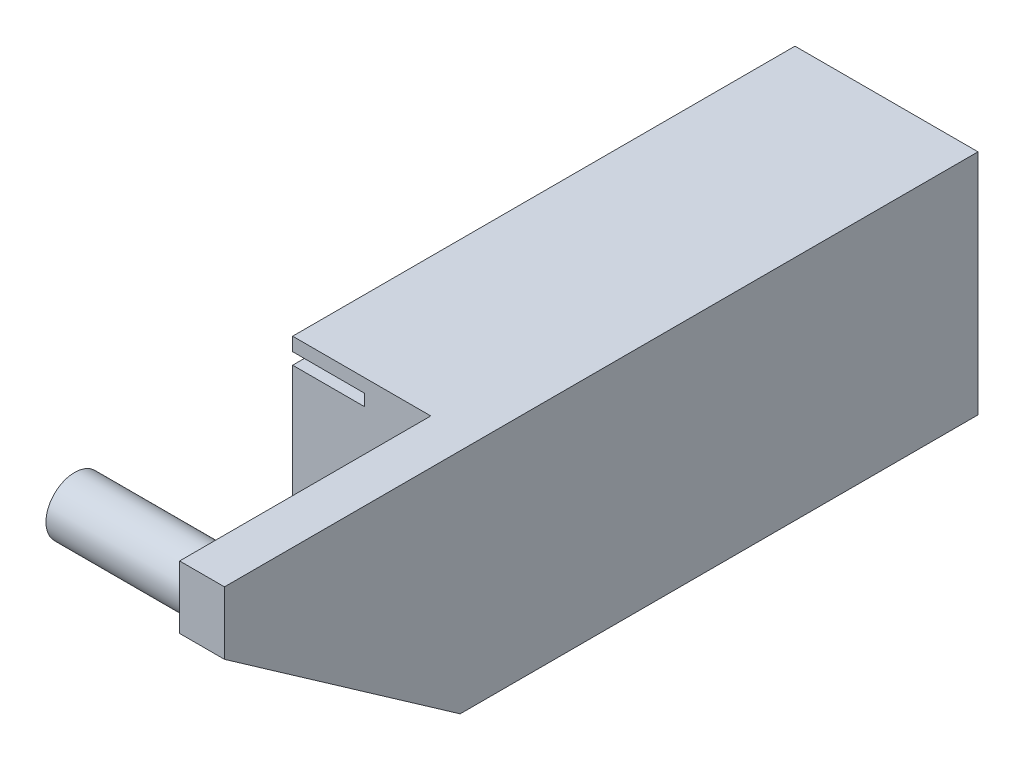
ISO-10303-21;
HEADER;
FILE_DESCRIPTION(('STEP AP214'),'2;1');
FILE_NAME('part.step','',(''),(''),'','','');
FILE_SCHEMA(('AUTOMOTIVE_DESIGN { 1 0 10303 214 1 1 1 1 }'));
ENDSEC;
DATA;
#1=APPLICATION_CONTEXT('core data for automotive mechanical design processes');
#2=APPLICATION_PROTOCOL_DEFINITION('international standard','automotive_design',2000,#1);
#3=PRODUCT_CONTEXT('',#1,'mechanical');
#4=PRODUCT('Part','Part','',(#3));
#5=PRODUCT_RELATED_PRODUCT_CATEGORY('part','',(#4));
#6=PRODUCT_DEFINITION_FORMATION('','',#4);
#7=PRODUCT_DEFINITION_CONTEXT('part definition',#1,'design');
#8=PRODUCT_DEFINITION('design','',#6,#7);
#9=PRODUCT_DEFINITION_SHAPE('','',#8);
#10=(LENGTH_UNIT() NAMED_UNIT(*) SI_UNIT(.MILLI.,.METRE.));
#11=(NAMED_UNIT(*) PLANE_ANGLE_UNIT() SI_UNIT($,.RADIAN.));
#12=(NAMED_UNIT(*) SI_UNIT($,.STERADIAN.) SOLID_ANGLE_UNIT());
#13=UNCERTAINTY_MEASURE_WITH_UNIT(LENGTH_MEASURE(1.E-05),#10,'distance_accuracy_value','');
#14=(GEOMETRIC_REPRESENTATION_CONTEXT(3) GLOBAL_UNCERTAINTY_ASSIGNED_CONTEXT((#13)) GLOBAL_UNIT_ASSIGNED_CONTEXT((#10,
#11,#12)) REPRESENTATION_CONTEXT('',''));
#15=CARTESIAN_POINT('',(0.,0.,0.));
#16=DIRECTION('',(0.,0.,1.));
#17=DIRECTION('',(1.,0.,0.));
#18=AXIS2_PLACEMENT_3D('',#15,#16,#17);
#19=CARTESIAN_POINT('',(-28.7781796503859,-0.00999999999999959,18.4558038197349));
#20=DIRECTION('',(1.,0.,0.));
#21=DIRECTION('',(0.,0.,-1.));
#22=AXIS2_PLACEMENT_3D('',#19,#20,#21);
#23=PLANE('',#22);
#24=DIRECTION('',(0.,-1.,0.));
#25=VECTOR('',#24,1.);
#26=CARTESIAN_POINT('',(-28.7781796503859,12.7,4.45580381973494));
#27=LINE('',#26,#25);
#28=CARTESIAN_POINT('',(-28.7781796503859,11.3,4.45580381973494));
#29=VERTEX_POINT('',#28);
#30=CARTESIAN_POINT('',(-28.7781796503859,0.,4.45580381973494));
#31=VERTEX_POINT('',#30);
#32=EDGE_CURVE('E357',#29,#31,#27,.T.);
#33=ORIENTED_EDGE('',*,*,#32,.F.);
#34=DIRECTION('',(0.,0.,1.));
#35=VECTOR('',#34,1.);
#36=CARTESIAN_POINT('',(-28.7781796503859,11.3,4.45580381973494));
#37=LINE('',#36,#35);
#38=CARTESIAN_POINT('',(-28.7781796503859,11.3,-5.54419618026506));
#39=VERTEX_POINT('',#38);
#40=EDGE_CURVE('E196',#39,#29,#37,.T.);
#41=ORIENTED_EDGE('',*,*,#40,.F.);
#42=DIRECTION('',(0.,-1.,0.));
#43=VECTOR('',#42,1.);
#44=CARTESIAN_POINT('',(-28.7781796503859,11.3,-5.54419618026506));
#45=LINE('',#44,#43);
#46=CARTESIAN_POINT('',(-28.7781796503859,11.95,-5.54419618026506));
#47=VERTEX_POINT('',#46);
#48=EDGE_CURVE('E792',#47,#39,#45,.T.);
#49=ORIENTED_EDGE('',*,*,#48,.F.);
#50=DIRECTION('',(0.,0.,-1.));
#51=VECTOR('',#50,1.);
#52=CARTESIAN_POINT('',(-28.7781796503859,11.95,4.45580381973494));
#53=LINE('',#52,#51);
#54=CARTESIAN_POINT('',(-28.7781796503859,11.95,4.45580381973494));
#55=VERTEX_POINT('',#54);
#56=EDGE_CURVE('E795',#55,#47,#53,.T.);
#57=ORIENTED_EDGE('',*,*,#56,.F.);
#58=CARTESIAN_POINT('',(-28.7781796503859,12.7,4.45580381973494));
#59=VERTEX_POINT('',#58);
#60=EDGE_CURVE('E201',#59,#55,#27,.T.);
#61=ORIENTED_EDGE('',*,*,#60,.F.);
#62=DIRECTION('',(0.,0.,-1.));
#63=VECTOR('',#62,1.);
#64=CARTESIAN_POINT('',(-28.7781796503859,12.7,0.));
#65=LINE('',#64,#63);
#66=CARTESIAN_POINT('',(-28.7781796503859,12.7,-23.5441961802651));
#67=VERTEX_POINT('',#66);
#68=EDGE_CURVE('E365',#59,#67,#65,.T.);
#69=ORIENTED_EDGE('',*,*,#68,.T.);
#70=DIRECTION('',(0.,1.,0.));
#71=VECTOR('',#70,1.);
#72=CARTESIAN_POINT('',(-28.7781796503859,-12.963024338479,-23.5441961802651));
#73=LINE('',#72,#71);
#74=CARTESIAN_POINT('',(-28.7781796503859,0.,-23.5441961802651));
#75=VERTEX_POINT('',#74);
#76=EDGE_CURVE('E274',#75,#67,#73,.T.);
#77=ORIENTED_EDGE('',*,*,#76,.F.);
#78=DIRECTION('',(0.,0.,-1.));
#79=VECTOR('',#78,1.);
#80=CARTESIAN_POINT('',(-28.7781796503859,0.,0.));
#81=LINE('',#80,#79);
#82=EDGE_CURVE('E364',#31,#75,#81,.T.);
#83=ORIENTED_EDGE('',*,*,#82,.F.);
#84=EDGE_LOOP('',(#33,#41,#49,#57,#61,#69,#77,#83));
#85=FACE_BOUND('',#84,.T.);
#86=CARTESIAN_POINT('',(-28.7781796503859,9.2,-12.2941961802651));
#87=DIRECTION('',(1.,0.,0.));
#88=DIRECTION('',(0.,0.,-1.));
#89=AXIS2_PLACEMENT_3D('',#86,#87,#88);
#90=CIRCLE('',#89,1.6);
#91=CARTESIAN_POINT('',(-28.7781796503859,9.2,-13.8941961802651));
#92=VERTEX_POINT('',#91);
#93=EDGE_CURVE('E368',#92,#92,#90,.F.);
#94=ORIENTED_EDGE('',*,*,#93,.F.);
#95=EDGE_LOOP('',(#94));
#96=FACE_BOUND('',#95,.T.);
#97=ADVANCED_FACE('F47',(#85,#96),#23,.F.);
#98=CARTESIAN_POINT('',(0.,0.,0.));
#99=DIRECTION('',(0.,1.,0.));
#100=DIRECTION('',(0.,0.,1.));
#101=AXIS2_PLACEMENT_3D('',#98,#99,#100);
#102=PLANE('',#101);
#103=ORIENTED_EDGE('',*,*,#82,.T.);
#104=DIRECTION('',(1.,0.,0.));
#105=VECTOR('',#104,1.);
#106=CARTESIAN_POINT('',(0.,0.,-23.5441961802651));
#107=LINE('',#106,#105);
#108=CARTESIAN_POINT('',(-18.5781796503859,0.,-23.5441961802651));
#109=VERTEX_POINT('',#108);
#110=EDGE_CURVE('E319',#75,#109,#107,.T.);
#111=ORIENTED_EDGE('',*,*,#110,.T.);
#112=DIRECTION('',(0.,0.,1.));
#113=VECTOR('',#112,1.);
#114=CARTESIAN_POINT('',(-18.5781796503859,0.,0.));
#115=LINE('',#114,#113);
#116=CARTESIAN_POINT('',(-18.5781796503859,0.,5.31684215770762));
#117=VERTEX_POINT('',#116);
#118=EDGE_CURVE('E341',#109,#117,#115,.T.);
#119=ORIENTED_EDGE('',*,*,#118,.T.);
#120=DIRECTION('',(1.,0.,0.));
#121=VECTOR('',#120,1.);
#122=CARTESIAN_POINT('',(0.,0.,5.31684215770762));
#123=LINE('',#122,#121);
#124=CARTESIAN_POINT('',(-21.0781796503859,0.,5.31684215770762));
#125=VERTEX_POINT('',#124);
#126=EDGE_CURVE('E360',#125,#117,#123,.T.);
#127=ORIENTED_EDGE('',*,*,#126,.F.);
#128=DIRECTION('',(0.,0.,1.));
#129=VECTOR('',#128,1.);
#130=CARTESIAN_POINT('',(-21.0781796503859,0.,0.));
#131=LINE('',#130,#129);
#132=CARTESIAN_POINT('',(-21.0781796503859,0.,4.45580381973494));
#133=VERTEX_POINT('',#132);
#134=EDGE_CURVE('E337',#133,#125,#131,.T.);
#135=ORIENTED_EDGE('',*,*,#134,.F.);
#136=DIRECTION('',(1.,0.,0.));
#137=VECTOR('',#136,1.);
#138=CARTESIAN_POINT('',(0.,0.,4.45580381973494));
#139=LINE('',#138,#137);
#140=EDGE_CURVE('E314',#31,#133,#139,.T.);
#141=ORIENTED_EDGE('',*,*,#140,.F.);
#142=EDGE_LOOP('',(#103,#111,#119,#127,#135,#141));
#143=FACE_BOUND('',#142,.T.);
#144=DIRECTION('',(-1.,0.,0.));
#145=VECTOR('',#144,1.);
#146=CARTESIAN_POINT('',(-18.5781796503859,0.,-19.5441961802651));
#147=LINE('',#146,#145);
#148=CARTESIAN_POINT('',(-22.9281796503859,0.,-19.5441961802651));
#149=VERTEX_POINT('',#148);
#150=CARTESIAN_POINT('',(-24.4281796503859,0.,-19.5441961802651));
#151=VERTEX_POINT('',#150);
#152=EDGE_CURVE('E211',#149,#151,#147,.T.);
#153=ORIENTED_EDGE('',*,*,#152,.T.);
#154=DIRECTION('',(0.,0.,-1.));
#155=VECTOR('',#154,1.);
#156=CARTESIAN_POINT('',(-24.4281796503859,0.,4.45580381973494));
#157=LINE('',#156,#155);
#158=CARTESIAN_POINT('',(-24.4281796503859,0.,-2.40523451823775));
#159=VERTEX_POINT('',#158);
#160=EDGE_CURVE('E249',#159,#151,#157,.T.);
#161=ORIENTED_EDGE('',*,*,#160,.F.);
#162=DIRECTION('',(1.,0.,0.));
#163=VECTOR('',#162,1.);
#164=CARTESIAN_POINT('',(-28.7781796503859,0.,-2.40523451823775));
#165=LINE('',#164,#163);
#166=CARTESIAN_POINT('',(-22.9281796503859,0.,-2.40523451823775));
#167=VERTEX_POINT('',#166);
#168=EDGE_CURVE('E229',#159,#167,#165,.T.);
#169=ORIENTED_EDGE('',*,*,#168,.T.);
#170=DIRECTION('',(0.,0.,1.));
#171=VECTOR('',#170,1.);
#172=CARTESIAN_POINT('',(-22.9281796503859,0.,4.45580381973494));
#173=LINE('',#172,#171);
#174=EDGE_CURVE('E254',#149,#167,#173,.T.);
#175=ORIENTED_EDGE('',*,*,#174,.F.);
#176=EDGE_LOOP('',(#153,#161,#169,#175));
#177=FACE_BOUND('',#176,.T.);
#178=ADVANCED_FACE('F406',(#143,#177),#102,.F.);
#179=CARTESIAN_POINT('',(-21.0781796503859,12.7,0.));
#180=DIRECTION('',(1.,0.,0.));
#181=DIRECTION('',(0.,0.,-1.));
#182=AXIS2_PLACEMENT_3D('',#179,#180,#181);
#183=PLANE('',#182);
#184=CARTESIAN_POINT('',(-21.0781796503859,9.2,15.2058038197349));
#185=DIRECTION('',(1.,0.,0.));
#186=DIRECTION('',(0.,0.,-1.));
#187=AXIS2_PLACEMENT_3D('',#184,#185,#186);
#188=CIRCLE('',#187,1.6);
#189=CARTESIAN_POINT('',(-21.0781796503859,9.2,13.6058038197349));
#190=VERTEX_POINT('',#189);
#191=EDGE_CURVE('E310',#190,#190,#188,.T.);
#192=ORIENTED_EDGE('',*,*,#191,.T.);
#193=EDGE_LOOP('',(#192));
#194=FACE_BOUND('',#193,.T.);
#195=DIRECTION('',(0.,-0.57357643635105,-0.819152044288989));
#196=VECTOR('',#195,1.);
#197=CARTESIAN_POINT('',(-21.0781796503859,1.68007341914141,7.71623566243481));
#198=LINE('',#197,#196);
#199=CARTESIAN_POINT('',(-21.0781796503859,9.2,18.4558038197349));
#200=VERTEX_POINT('',#199);
#201=EDGE_CURVE('E307',#200,#125,#198,.T.);
#202=ORIENTED_EDGE('',*,*,#201,.F.);
#203=DIRECTION('',(0.,-1.,0.));
#204=VECTOR('',#203,1.);
#205=CARTESIAN_POINT('',(-21.0781796503859,12.7,18.4558038197349));
#206=LINE('',#205,#204);
#207=CARTESIAN_POINT('',(-21.0781796503859,12.7,18.4558038197349));
#208=VERTEX_POINT('',#207);
#209=EDGE_CURVE('E350',#208,#200,#206,.T.);
#210=ORIENTED_EDGE('',*,*,#209,.F.);
#211=DIRECTION('',(0.,0.,1.));
#212=VECTOR('',#211,1.);
#213=CARTESIAN_POINT('',(-21.0781796503859,12.7,0.));
#214=LINE('',#213,#212);
#215=CARTESIAN_POINT('',(-21.0781796503859,12.7,4.45580381973494));
#216=VERTEX_POINT('',#215);
#217=EDGE_CURVE('E318',#216,#208,#214,.T.);
#218=ORIENTED_EDGE('',*,*,#217,.F.);
#219=DIRECTION('',(0.,-1.,0.));
#220=VECTOR('',#219,1.);
#221=CARTESIAN_POINT('',(-21.0781796503859,12.7,4.45580381973494));
#222=LINE('',#221,#220);
#223=EDGE_CURVE('E354',#216,#133,#222,.T.);
#224=ORIENTED_EDGE('',*,*,#223,.T.);
#225=ORIENTED_EDGE('',*,*,#134,.T.);
#226=EDGE_LOOP('',(#202,#210,#218,#224,#225));
#227=FACE_BOUND('',#226,.T.);
#228=ADVANCED_FACE('F429',(#194,#227),#183,.F.);
#229=CARTESIAN_POINT('',(0.,12.7,18.4558038197349));
#230=DIRECTION('',(0.,0.,-1.));
#231=DIRECTION('',(-1.,0.,0.));
#232=AXIS2_PLACEMENT_3D('',#229,#230,#231);
#233=PLANE('',#232);
#234=DIRECTION('',(1.,0.,0.));
#235=VECTOR('',#234,1.);
#236=CARTESIAN_POINT('',(-21.5781796503859,9.2,18.4558038197349));
#237=LINE('',#236,#235);
#238=CARTESIAN_POINT('',(-18.5781796503859,9.2,18.4558038197349));
#239=VERTEX_POINT('',#238);
#240=EDGE_CURVE('E303',#200,#239,#237,.T.);
#241=ORIENTED_EDGE('',*,*,#240,.T.);
#242=DIRECTION('',(0.,-1.,0.));
#243=VECTOR('',#242,1.);
#244=CARTESIAN_POINT('',(-18.5781796503859,12.7,18.4558038197349));
#245=LINE('',#244,#243);
#246=CARTESIAN_POINT('',(-18.5781796503859,12.7,18.4558038197349));
#247=VERTEX_POINT('',#246);
#248=EDGE_CURVE('E333',#247,#239,#245,.T.);
#249=ORIENTED_EDGE('',*,*,#248,.F.);
#250=DIRECTION('',(1.,0.,0.));
#251=VECTOR('',#250,1.);
#252=CARTESIAN_POINT('',(0.,12.7,18.4558038197349));
#253=LINE('',#252,#251);
#254=EDGE_CURVE('E322',#208,#247,#253,.T.);
#255=ORIENTED_EDGE('',*,*,#254,.F.);
#256=ORIENTED_EDGE('',*,*,#209,.T.);
#257=EDGE_LOOP('',(#241,#249,#255,#256));
#258=FACE_BOUND('',#257,.T.);
#259=ADVANCED_FACE('F459',(#258),#233,.F.);
#260=CARTESIAN_POINT('',(-18.5781796503859,12.7,0.));
#261=DIRECTION('',(1.,0.,0.));
#262=DIRECTION('',(0.,0.,-1.));
#263=AXIS2_PLACEMENT_3D('',#260,#261,#262);
#264=PLANE('',#263);
#265=DIRECTION('',(0.,0.,1.));
#266=VECTOR('',#265,1.);
#267=CARTESIAN_POINT('',(-18.5781796503859,12.7,0.));
#268=LINE('',#267,#266);
#269=CARTESIAN_POINT('',(-18.5781796503859,12.7,-23.5441961802651));
#270=VERTEX_POINT('',#269);
#271=EDGE_CURVE('E326',#270,#247,#268,.T.);
#272=ORIENTED_EDGE('',*,*,#271,.T.);
#273=ORIENTED_EDGE('',*,*,#248,.T.);
#274=DIRECTION('',(0.,-0.57357643635105,-0.819152044288989));
#275=VECTOR('',#274,1.);
#276=CARTESIAN_POINT('',(-18.5781796503859,9.2,18.4558038197349));
#277=LINE('',#276,#275);
#278=EDGE_CURVE('E299',#239,#117,#277,.T.);
#279=ORIENTED_EDGE('',*,*,#278,.T.);
#280=ORIENTED_EDGE('',*,*,#118,.F.);
#281=DIRECTION('',(0.,1.,0.));
#282=VECTOR('',#281,1.);
#283=CARTESIAN_POINT('',(-18.5781796503859,-12.963024338479,-23.5441961802651));
#284=LINE('',#283,#282);
#285=EDGE_CURVE('E285',#109,#270,#284,.T.);
#286=ORIENTED_EDGE('',*,*,#285,.T.);
#287=EDGE_LOOP('',(#272,#273,#279,#280,#286));
#288=FACE_BOUND('',#287,.T.);
#289=ADVANCED_FACE('F456',(#288),#264,.T.);
#290=CARTESIAN_POINT('',(0.,12.7,4.45580381973494));
#291=DIRECTION('',(0.,0.,-1.));
#292=DIRECTION('',(-1.,0.,0.));
#293=AXIS2_PLACEMENT_3D('',#290,#291,#292);
#294=PLANE('',#293);
#295=DIRECTION('',(0.,-1.,0.));
#296=VECTOR('',#295,1.);
#297=CARTESIAN_POINT('',(-22.9281796503859,3.,4.45580381973494));
#298=LINE('',#297,#296);
#299=CARTESIAN_POINT('',(-22.9281796503859,3.,4.45580381973494));
#300=VERTEX_POINT('',#299);
#301=CARTESIAN_POINT('',(-22.9281796503859,1.,4.45580381973494));
#302=VERTEX_POINT('',#301);
#303=EDGE_CURVE('E275',#300,#302,#298,.T.);
#304=ORIENTED_EDGE('',*,*,#303,.T.);
#305=DIRECTION('',(-1.,0.,0.));
#306=VECTOR('',#305,1.);
#307=CARTESIAN_POINT('',(-28.7781796503859,1.,4.45580381973494));
#308=LINE('',#307,#306);
#309=CARTESIAN_POINT('',(-24.4281796503859,1.,4.45580381973494));
#310=VERTEX_POINT('',#309);
#311=EDGE_CURVE('E234',#302,#310,#308,.T.);
#312=ORIENTED_EDGE('',*,*,#311,.T.);
#313=DIRECTION('',(0.,-1.,0.));
#314=VECTOR('',#313,1.);
#315=CARTESIAN_POINT('',(-24.4281796503859,3.,4.45580381973494));
#316=LINE('',#315,#314);
#317=CARTESIAN_POINT('',(-24.4281796503859,3.,4.45580381973494));
#318=VERTEX_POINT('',#317);
#319=EDGE_CURVE('E271',#318,#310,#316,.T.);
#320=ORIENTED_EDGE('',*,*,#319,.F.);
#321=DIRECTION('',(-1.,0.,0.));
#322=VECTOR('',#321,1.);
#323=CARTESIAN_POINT('',(-24.4281796503859,3.,4.45580381973494));
#324=LINE('',#323,#322);
#325=EDGE_CURVE('E262',#300,#318,#324,.T.);
#326=ORIENTED_EDGE('',*,*,#325,.F.);
#327=EDGE_LOOP('',(#304,#312,#320,#326));
#328=FACE_BOUND('',#327,.T.);
#329=DIRECTION('',(0.,1.,0.));
#330=VECTOR('',#329,1.);
#331=CARTESIAN_POINT('',(-24.7781796503859,11.3,4.45580381973494));
#332=LINE('',#331,#330);
#333=CARTESIAN_POINT('',(-24.7781796503859,11.3,4.45580381973494));
#334=VERTEX_POINT('',#333);
#335=CARTESIAN_POINT('',(-24.7781796503859,11.95,4.45580381973494));
#336=VERTEX_POINT('',#335);
#337=EDGE_CURVE('E189',#334,#336,#332,.T.);
#338=ORIENTED_EDGE('',*,*,#337,.F.);
#339=DIRECTION('',(-1.,0.,0.));
#340=VECTOR('',#339,1.);
#341=CARTESIAN_POINT('',(-24.7781796503859,11.3,4.45580381973494));
#342=LINE('',#341,#340);
#343=EDGE_CURVE('E221',#334,#29,#342,.T.);
#344=ORIENTED_EDGE('',*,*,#343,.T.);
#345=ORIENTED_EDGE('',*,*,#32,.T.);
#346=ORIENTED_EDGE('',*,*,#140,.T.);
#347=ORIENTED_EDGE('',*,*,#223,.F.);
#348=DIRECTION('',(1.,0.,0.));
#349=VECTOR('',#348,1.);
#350=CARTESIAN_POINT('',(0.,12.7,4.45580381973494));
#351=LINE('',#350,#349);
#352=EDGE_CURVE('E315',#59,#216,#351,.T.);
#353=ORIENTED_EDGE('',*,*,#352,.F.);
#354=ORIENTED_EDGE('',*,*,#60,.T.);
#355=DIRECTION('',(-1.,0.,0.));
#356=VECTOR('',#355,1.);
#357=CARTESIAN_POINT('',(-24.7781796503859,11.95,4.45580381973494));
#358=LINE('',#357,#356);
#359=EDGE_CURVE('E183',#336,#55,#358,.T.);
#360=ORIENTED_EDGE('',*,*,#359,.F.);
#361=EDGE_LOOP('',(#338,#344,#345,#346,#347,#353,#354,#360));
#362=FACE_BOUND('',#361,.T.);
#363=ADVANCED_FACE('F199',(#328,#362),#294,.F.);
#364=CARTESIAN_POINT('',(0.,12.7,-23.5441961802651));
#365=DIRECTION('',(0.,0.,-1.));
#366=DIRECTION('',(-1.,0.,0.));
#367=AXIS2_PLACEMENT_3D('',#364,#365,#366);
#368=PLANE('',#367);
#369=DIRECTION('',(1.,0.,0.));
#370=VECTOR('',#369,1.);
#371=CARTESIAN_POINT('',(-18.5781796503859,1.,-23.5441961802651));
#372=LINE('',#371,#370);
#373=CARTESIAN_POINT('',(-24.4281796503859,1.,-23.5441961802651));
#374=VERTEX_POINT('',#373);
#375=CARTESIAN_POINT('',(-22.9281796503859,1.,-23.5441961802651));
#376=VERTEX_POINT('',#375);
#377=EDGE_CURVE('E217',#374,#376,#372,.T.);
#378=ORIENTED_EDGE('',*,*,#377,.T.);
#379=DIRECTION('',(0.,-1.,0.));
#380=VECTOR('',#379,1.);
#381=CARTESIAN_POINT('',(-22.9281796503859,3.,-23.5441961802651));
#382=LINE('',#381,#380);
#383=CARTESIAN_POINT('',(-22.9281796503859,3.,-23.5441961802651));
#384=VERTEX_POINT('',#383);
#385=EDGE_CURVE('E279',#384,#376,#382,.T.);
#386=ORIENTED_EDGE('',*,*,#385,.F.);
#387=DIRECTION('',(1.,0.,0.));
#388=VECTOR('',#387,1.);
#389=CARTESIAN_POINT('',(-24.4281796503859,3.,-23.5441961802651));
#390=LINE('',#389,#388);
#391=CARTESIAN_POINT('',(-24.4281796503859,3.,-23.5441961802651));
#392=VERTEX_POINT('',#391);
#393=EDGE_CURVE('E253',#392,#384,#390,.T.);
#394=ORIENTED_EDGE('',*,*,#393,.F.);
#395=DIRECTION('',(0.,-1.,0.));
#396=VECTOR('',#395,1.);
#397=CARTESIAN_POINT('',(-24.4281796503859,3.,-23.5441961802651));
#398=LINE('',#397,#396);
#399=EDGE_CURVE('E266',#392,#374,#398,.T.);
#400=ORIENTED_EDGE('',*,*,#399,.T.);
#401=EDGE_LOOP('',(#378,#386,#394,#400));
#402=FACE_BOUND('',#401,.T.);
#403=ORIENTED_EDGE('',*,*,#76,.T.);
#404=DIRECTION('',(1.,0.,0.));
#405=VECTOR('',#404,1.);
#406=CARTESIAN_POINT('',(0.,12.7,-23.5441961802651));
#407=LINE('',#406,#405);
#408=EDGE_CURVE('E329',#67,#270,#407,.T.);
#409=ORIENTED_EDGE('',*,*,#408,.T.);
#410=ORIENTED_EDGE('',*,*,#285,.F.);
#411=ORIENTED_EDGE('',*,*,#110,.F.);
#412=EDGE_LOOP('',(#403,#409,#410,#411));
#413=FACE_BOUND('',#412,.T.);
#414=ADVANCED_FACE('F390',(#402,#413),#368,.T.);
#415=CARTESIAN_POINT('',(0.,12.7,0.));
#416=DIRECTION('',(0.,1.,0.));
#417=DIRECTION('',(0.,0.,1.));
#418=AXIS2_PLACEMENT_3D('',#415,#416,#417);
#419=PLANE('',#418);
#420=ORIENTED_EDGE('',*,*,#408,.F.);
#421=ORIENTED_EDGE('',*,*,#68,.F.);
#422=ORIENTED_EDGE('',*,*,#352,.T.);
#423=ORIENTED_EDGE('',*,*,#217,.T.);
#424=ORIENTED_EDGE('',*,*,#254,.T.);
#425=ORIENTED_EDGE('',*,*,#271,.F.);
#426=EDGE_LOOP('',(#420,#421,#422,#423,#424,#425));
#427=FACE_BOUND('',#426,.T.);
#428=ADVANCED_FACE('F446',(#427),#419,.T.);
#429=CARTESIAN_POINT('',(-31.2801796503859,9.2,15.2058038197349));
#430=DIRECTION('',(1.,0.,0.));
#431=DIRECTION('',(0.,0.,-1.));
#432=AXIS2_PLACEMENT_3D('',#429,#430,#431);
#433=CYLINDRICAL_SURFACE('',#432,1.6);
#434=CARTESIAN_POINT('',(-30.1781796503859,9.2,15.2058038197349));
#435=DIRECTION('',(-1.,0.,0.));
#436=DIRECTION('',(0.,0.,1.));
#437=AXIS2_PLACEMENT_3D('',#434,#435,#436);
#438=CIRCLE('',#437,1.6);
#439=CARTESIAN_POINT('',(-30.1781796503859,9.2,13.6058038197349));
#440=VERTEX_POINT('',#439);
#441=EDGE_CURVE('E295',#440,#440,#438,.T.);
#442=CARTESIAN_POINT('',(-21.0781796503859,9.2,13.6058038197349));
#443=CARTESIAN_POINT('',(-21.1729713170526,9.2,13.6058038197349));
#444=CARTESIAN_POINT('',(-21.2677629837193,9.2,13.6058038197349));
#445=CARTESIAN_POINT('',(-21.4573463170526,9.2,13.6058038197349));
#446=CARTESIAN_POINT('',(-21.5521379837193,9.2,13.6058038197349));
#447=CARTESIAN_POINT('',(-21.7417213170526,9.2,13.6058038197349));
#448=CARTESIAN_POINT('',(-21.8365129837193,9.2,13.6058038197349));
#449=CARTESIAN_POINT('',(-22.0260963170526,9.2,13.6058038197349));
#450=CARTESIAN_POINT('',(-22.1208879837193,9.2,13.6058038197349));
#451=CARTESIAN_POINT('',(-22.3104713170526,9.2,13.6058038197349));
#452=CARTESIAN_POINT('',(-22.4052629837193,9.2,13.6058038197349));
#453=CARTESIAN_POINT('',(-22.5948463170526,9.2,13.6058038197349));
#454=CARTESIAN_POINT('',(-22.6896379837193,9.2,13.6058038197349));
#455=CARTESIAN_POINT('',(-22.8792213170526,9.2,13.6058038197349));
#456=CARTESIAN_POINT('',(-22.9740129837193,9.2,13.6058038197349));
#457=CARTESIAN_POINT('',(-23.1635963170526,9.2,13.6058038197349));
#458=CARTESIAN_POINT('',(-23.2583879837193,9.2,13.6058038197349));
#459=CARTESIAN_POINT('',(-23.4479713170526,9.2,13.6058038197349));
#460=CARTESIAN_POINT('',(-23.5427629837193,9.2,13.6058038197349));
#461=CARTESIAN_POINT('',(-23.7323463170526,9.2,13.6058038197349));
#462=CARTESIAN_POINT('',(-23.8271379837193,9.2,13.6058038197349));
#463=CARTESIAN_POINT('',(-24.0167213170526,9.2,13.6058038197349));
#464=CARTESIAN_POINT('',(-24.1115129837193,9.2,13.6058038197349));
#465=CARTESIAN_POINT('',(-24.3010963170526,9.2,13.6058038197349));
#466=CARTESIAN_POINT('',(-24.3958879837193,9.2,13.6058038197349));
#467=CARTESIAN_POINT('',(-24.5854713170526,9.2,13.6058038197349));
#468=CARTESIAN_POINT('',(-24.6802629837193,9.2,13.6058038197349));
#469=CARTESIAN_POINT('',(-24.8698463170526,9.2,13.6058038197349));
#470=CARTESIAN_POINT('',(-24.9646379837193,9.2,13.6058038197349));
#471=CARTESIAN_POINT('',(-25.1542213170526,9.2,13.6058038197349));
#472=CARTESIAN_POINT('',(-25.2490129837193,9.2,13.6058038197349));
#473=CARTESIAN_POINT('',(-25.4385963170526,9.2,13.6058038197349));
#474=CARTESIAN_POINT('',(-25.5333879837193,9.2,13.6058038197349));
#475=CARTESIAN_POINT('',(-25.7229713170526,9.2,13.6058038197349));
#476=CARTESIAN_POINT('',(-25.8177629837193,9.2,13.6058038197349));
#477=CARTESIAN_POINT('',(-26.0073463170526,9.2,13.6058038197349));
#478=CARTESIAN_POINT('',(-26.1021379837193,9.2,13.6058038197349));
#479=CARTESIAN_POINT('',(-26.2917213170526,9.2,13.6058038197349));
#480=CARTESIAN_POINT('',(-26.3865129837193,9.2,13.6058038197349));
#481=CARTESIAN_POINT('',(-26.5760963170526,9.2,13.6058038197349));
#482=CARTESIAN_POINT('',(-26.6708879837193,9.2,13.6058038197349));
#483=CARTESIAN_POINT('',(-26.8604713170526,9.2,13.6058038197349));
#484=CARTESIAN_POINT('',(-26.9552629837193,9.2,13.6058038197349));
#485=CARTESIAN_POINT('',(-27.1448463170526,9.2,13.6058038197349));
#486=CARTESIAN_POINT('',(-27.2396379837193,9.2,13.6058038197349));
#487=CARTESIAN_POINT('',(-27.4292213170526,9.2,13.6058038197349));
#488=CARTESIAN_POINT('',(-27.5240129837193,9.2,13.6058038197349));
#489=CARTESIAN_POINT('',(-27.7135963170526,9.2,13.6058038197349));
#490=CARTESIAN_POINT('',(-27.8083879837193,9.2,13.6058038197349));
#491=CARTESIAN_POINT('',(-27.9979713170526,9.2,13.6058038197349));
#492=CARTESIAN_POINT('',(-28.0927629837193,9.2,13.6058038197349));
#493=CARTESIAN_POINT('',(-28.2823463170526,9.2,13.6058038197349));
#494=CARTESIAN_POINT('',(-28.3771379837193,9.2,13.6058038197349));
#495=CARTESIAN_POINT('',(-28.5667213170526,9.2,13.6058038197349));
#496=CARTESIAN_POINT('',(-28.6615129837193,9.2,13.6058038197349));
#497=CARTESIAN_POINT('',(-28.8510963170526,9.2,13.6058038197349));
#498=CARTESIAN_POINT('',(-28.9458879837193,9.2,13.6058038197349));
#499=CARTESIAN_POINT('',(-29.1354713170526,9.2,13.6058038197349));
#500=CARTESIAN_POINT('',(-29.2302629837193,9.2,13.6058038197349));
#501=CARTESIAN_POINT('',(-29.4198463170526,9.2,13.6058038197349));
#502=CARTESIAN_POINT('',(-29.5146379837193,9.2,13.6058038197349));
#503=CARTESIAN_POINT('',(-29.7042213170526,9.2,13.6058038197349));
#504=CARTESIAN_POINT('',(-29.7990129837193,9.2,13.6058038197349));
#505=CARTESIAN_POINT('',(-29.9885963170526,9.2,13.6058038197349));
#506=CARTESIAN_POINT('',(-30.0833879837193,9.2,13.6058038197349));
#507=CARTESIAN_POINT('',(-30.1781796503859,9.2,13.6058038197349));
#508=B_SPLINE_CURVE_WITH_KNOTS('',3,(#442,#443,#444,#445,#446,#447,#448,#449,#450,#451,#452,
#453,#454,#455,#456,#457,#458,#459,#460,#461,#462,#463,#464,#465,#466,#467,#468,#469,#470,#471,
#472,#473,#474,#475,#476,#477,#478,#479,#480,#481,#482,#483,#484,#485,#486,#487,#488,#489,#490,
#491,#492,#493,#494,#495,#496,#497,#498,#499,#500,#501,#502,#503,#504,#505,#506,#507),
.UNSPECIFIED.,.F.,.F.,(4,2,2,2,2,2,2,2,2,2,2,2,2,2,2,2,2,2,2,2,2,2,2,2,2,2,2,2,2,2,2,2,4),(0.,
0.284374999999996,0.56875,0.853124999999996,1.1375,1.421875,1.70625,1.990625,2.275,2.559375,
2.84375,3.128125,3.4125,3.696875,3.98125,4.26562499999999,4.55,4.834375,5.11875,
5.40312499999999,5.6875,5.97187499999999,6.25625,6.54062499999999,6.825,7.109375,7.39375,
7.678125,7.9625,8.246875,8.53125,8.815625,9.1),.UNSPECIFIED.);
#509=EDGE_CURVE('BSEAM436',#190,#440,#508,.T.);
#510=ORIENTED_EDGE('',*,*,#191,.F.);
#511=ORIENTED_EDGE('',*,*,#441,.F.);
#512=ORIENTED_EDGE('',*,*,#509,.T.);
#513=ORIENTED_EDGE('',*,*,#509,.F.);
#514=EDGE_LOOP('',(#510,#512,#511,#513));
#515=FACE_BOUND('',#514,.T.);
#516=ADVANCED_FACE('F436',(#515),#433,.T.);
#517=CARTESIAN_POINT('',(-21.5781796503859,9.2,18.4558038197349));
#518=DIRECTION('',(0.,-0.819152044288989,0.57357643635105));
#519=DIRECTION('',(0.,-0.57357643635105,-0.819152044288989));
#520=AXIS2_PLACEMENT_3D('',#517,#518,#519);
#521=PLANE('',#520);
#522=ORIENTED_EDGE('',*,*,#201,.T.);
#523=ORIENTED_EDGE('',*,*,#126,.T.);
#524=ORIENTED_EDGE('',*,*,#278,.F.);
#525=ORIENTED_EDGE('',*,*,#240,.F.);
#526=EDGE_LOOP('',(#522,#523,#524,#525));
#527=FACE_BOUND('',#526,.T.);
#528=ADVANCED_FACE('F425',(#527),#521,.T.);
#529=CARTESIAN_POINT('',(-30.1781796503859,9.2,15.2058038197349));
#530=DIRECTION('',(-1.,0.,0.));
#531=DIRECTION('',(0.,0.,1.));
#532=AXIS2_PLACEMENT_3D('',#529,#530,#531);
#533=PLANE('',#532);
#534=ORIENTED_EDGE('',*,*,#441,.T.);
#535=EDGE_LOOP('',(#534));
#536=FACE_BOUND('',#535,.T.);
#537=ADVANCED_FACE('F432',(#536),#533,.T.);
#538=CARTESIAN_POINT('',(-30.1781796503859,9.2,-12.2941961802651));
#539=DIRECTION('',(1.,0.,0.));
#540=DIRECTION('',(0.,0.,-1.));
#541=AXIS2_PLACEMENT_3D('',#538,#539,#540);
#542=CYLINDRICAL_SURFACE('',#541,1.6);
#543=CARTESIAN_POINT('',(-30.1781796503859,9.2,-12.2941961802651));
#544=DIRECTION('',(-1.,0.,0.));
#545=DIRECTION('',(0.,0.,-1.));
#546=AXIS2_PLACEMENT_3D('',#543,#544,#545);
#547=CIRCLE('',#546,1.6);
#548=CARTESIAN_POINT('',(-30.1781796503859,9.2,-13.8941961802651));
#549=VERTEX_POINT('',#548);
#550=EDGE_CURVE('E288',#549,#549,#547,.T.);
#551=ORIENTED_EDGE('',*,*,#550,.F.);
#552=EDGE_LOOP('',(#551));
#553=FACE_BOUND('',#552,.T.);
#554=ORIENTED_EDGE('',*,*,#93,.T.);
#555=EDGE_LOOP('',(#554));
#556=FACE_BOUND('',#555,.T.);
#557=ADVANCED_FACE('F443',(#553,#556),#542,.T.);
#558=CARTESIAN_POINT('',(-30.1781796503859,9.2,-12.2941961802651));
#559=DIRECTION('',(1.,0.,0.));
#560=DIRECTION('',(0.,0.,-1.));
#561=AXIS2_PLACEMENT_3D('',#558,#559,#560);
#562=PLANE('',#561);
#563=ORIENTED_EDGE('',*,*,#550,.T.);
#564=EDGE_LOOP('',(#563));
#565=FACE_BOUND('',#564,.T.);
#566=ADVANCED_FACE('F504',(#565),#562,.F.);
#567=CARTESIAN_POINT('',(-24.4281796503859,3.,4.45580381973494));
#568=DIRECTION('',(-1.,0.,0.));
#569=DIRECTION('',(0.,0.,1.));
#570=AXIS2_PLACEMENT_3D('',#567,#568,#569);
#571=PLANE('',#570);
#572=ORIENTED_EDGE('',*,*,#160,.T.);
#573=DIRECTION('',(0.,1.,0.));
#574=VECTOR('',#573,1.);
#575=CARTESIAN_POINT('',(-24.4281796503859,3.,-19.5441961802651));
#576=LINE('',#575,#574);
#577=CARTESIAN_POINT('',(-24.4281796503859,1.,-19.5441961802651));
#578=VERTEX_POINT('',#577);
#579=EDGE_CURVE('E70',#151,#578,#576,.T.);
#580=ORIENTED_EDGE('',*,*,#579,.T.);
#581=DIRECTION('',(0.,0.,1.));
#582=VECTOR('',#581,1.);
#583=CARTESIAN_POINT('',(-24.4281796503859,1.,4.45580381973494));
#584=LINE('',#583,#582);
#585=EDGE_CURVE('E215',#374,#578,#584,.T.);
#586=ORIENTED_EDGE('',*,*,#585,.F.);
#587=ORIENTED_EDGE('',*,*,#399,.F.);
#588=DIRECTION('',(0.,0.,-1.));
#589=VECTOR('',#588,1.);
#590=CARTESIAN_POINT('',(-24.4281796503859,3.,4.45580381973494));
#591=LINE('',#590,#589);
#592=EDGE_CURVE('E250',#318,#392,#591,.T.);
#593=ORIENTED_EDGE('',*,*,#592,.F.);
#594=ORIENTED_EDGE('',*,*,#319,.T.);
#595=DIRECTION('',(0.,0.,1.));
#596=VECTOR('',#595,1.);
#597=CARTESIAN_POINT('',(-24.4281796503859,1.,4.45580381973494));
#598=LINE('',#597,#596);
#599=CARTESIAN_POINT('',(-24.4281796503859,1.,-2.40523451823775));
#600=VERTEX_POINT('',#599);
#601=EDGE_CURVE('E238',#600,#310,#598,.T.);
#602=ORIENTED_EDGE('',*,*,#601,.F.);
#603=DIRECTION('',(0.,-1.,0.));
#604=VECTOR('',#603,1.);
#605=CARTESIAN_POINT('',(-24.4281796503859,3.,-2.40523451823775));
#606=LINE('',#605,#604);
#607=EDGE_CURVE('E245',#600,#159,#606,.T.);
#608=ORIENTED_EDGE('',*,*,#607,.T.);
#609=EDGE_LOOP('',(#572,#580,#586,#587,#593,#594,#602,#608));
#610=FACE_BOUND('',#609,.T.);
#611=ADVANCED_FACE('F394',(#610),#571,.F.);
#612=CARTESIAN_POINT('',(-22.9281796503859,3.,4.45580381973494));
#613=DIRECTION('',(1.,0.,0.));
#614=DIRECTION('',(0.,0.,-1.));
#615=AXIS2_PLACEMENT_3D('',#612,#613,#614);
#616=PLANE('',#615);
#617=DIRECTION('',(0.,0.,-1.));
#618=VECTOR('',#617,1.);
#619=CARTESIAN_POINT('',(-22.9281796503859,1.,4.45580381973494));
#620=LINE('',#619,#618);
#621=CARTESIAN_POINT('',(-22.9281796503859,1.,-19.5441961802651));
#622=VERTEX_POINT('',#621);
#623=EDGE_CURVE('E55',#622,#376,#620,.T.);
#624=ORIENTED_EDGE('',*,*,#623,.F.);
#625=DIRECTION('',(0.,-1.,0.));
#626=VECTOR('',#625,1.);
#627=CARTESIAN_POINT('',(-22.9281796503859,3.,-19.5441961802651));
#628=LINE('',#627,#626);
#629=EDGE_CURVE('E11',#622,#149,#628,.T.);
#630=ORIENTED_EDGE('',*,*,#629,.T.);
#631=ORIENTED_EDGE('',*,*,#174,.T.);
#632=DIRECTION('',(0.,1.,0.));
#633=VECTOR('',#632,1.);
#634=CARTESIAN_POINT('',(-22.9281796503859,3.,-2.40523451823775));
#635=LINE('',#634,#633);
#636=CARTESIAN_POINT('',(-22.9281796503859,1.,-2.40523451823775));
#637=VERTEX_POINT('',#636);
#638=EDGE_CURVE('E378',#167,#637,#635,.T.);
#639=ORIENTED_EDGE('',*,*,#638,.T.);
#640=DIRECTION('',(0.,0.,-1.));
#641=VECTOR('',#640,1.);
#642=CARTESIAN_POINT('',(-22.9281796503859,1.,4.45580381973494));
#643=LINE('',#642,#641);
#644=EDGE_CURVE('E374',#302,#637,#643,.T.);
#645=ORIENTED_EDGE('',*,*,#644,.F.);
#646=ORIENTED_EDGE('',*,*,#303,.F.);
#647=DIRECTION('',(0.,0.,1.));
#648=VECTOR('',#647,1.);
#649=CARTESIAN_POINT('',(-22.9281796503859,3.,4.45580381973494));
#650=LINE('',#649,#648);
#651=EDGE_CURVE('E258',#384,#300,#650,.T.);
#652=ORIENTED_EDGE('',*,*,#651,.F.);
#653=ORIENTED_EDGE('',*,*,#385,.T.);
#654=EDGE_LOOP('',(#624,#630,#631,#639,#645,#646,#652,#653));
#655=FACE_BOUND('',#654,.T.);
#656=ADVANCED_FACE('F398',(#655),#616,.F.);
#657=CARTESIAN_POINT('',(0.,3.,0.));
#658=DIRECTION('',(0.,-1.,0.));
#659=DIRECTION('',(0.,0.,-1.));
#660=AXIS2_PLACEMENT_3D('',#657,#658,#659);
#661=PLANE('',#660);
#662=ORIENTED_EDGE('',*,*,#592,.T.);
#663=ORIENTED_EDGE('',*,*,#393,.T.);
#664=ORIENTED_EDGE('',*,*,#651,.T.);
#665=ORIENTED_EDGE('',*,*,#325,.T.);
#666=EDGE_LOOP('',(#662,#663,#664,#665));
#667=FACE_BOUND('',#666,.T.);
#668=ADVANCED_FACE('F414',(#667),#661,.T.);
#669=CARTESIAN_POINT('',(-28.7781796503859,1.,-2.40523451823775));
#670=DIRECTION('',(0.,0.,-1.));
#671=DIRECTION('',(-1.,0.,0.));
#672=AXIS2_PLACEMENT_3D('',#669,#670,#671);
#673=PLANE('',#672);
#674=ORIENTED_EDGE('',*,*,#607,.F.);
#675=DIRECTION('',(1.,0.,0.));
#676=VECTOR('',#675,1.);
#677=CARTESIAN_POINT('',(-28.7781796503859,1.,-2.40523451823775));
#678=LINE('',#677,#676);
#679=EDGE_CURVE('E230',#600,#637,#678,.T.);
#680=ORIENTED_EDGE('',*,*,#679,.T.);
#681=ORIENTED_EDGE('',*,*,#638,.F.);
#682=ORIENTED_EDGE('',*,*,#168,.F.);
#683=EDGE_LOOP('',(#674,#680,#681,#682));
#684=FACE_BOUND('',#683,.T.);
#685=ADVANCED_FACE('F404',(#684),#673,.T.);
#686=CARTESIAN_POINT('',(0.,1.,0.));
#687=DIRECTION('',(0.,-1.,0.));
#688=DIRECTION('',(0.,0.,-1.));
#689=AXIS2_PLACEMENT_3D('',#686,#687,#688);
#690=PLANE('',#689);
#691=ORIENTED_EDGE('',*,*,#679,.F.);
#692=ORIENTED_EDGE('',*,*,#601,.T.);
#693=ORIENTED_EDGE('',*,*,#311,.F.);
#694=ORIENTED_EDGE('',*,*,#644,.T.);
#695=EDGE_LOOP('',(#691,#692,#693,#694));
#696=FACE_BOUND('',#695,.T.);
#697=ADVANCED_FACE('F408',(#696),#690,.F.);
#698=CARTESIAN_POINT('',(-18.5781796503859,1.,-19.5441961802651));
#699=DIRECTION('',(0.,0.,1.));
#700=DIRECTION('',(1.,0.,0.));
#701=AXIS2_PLACEMENT_3D('',#698,#699,#700);
#702=PLANE('',#701);
#703=ORIENTED_EDGE('',*,*,#579,.F.);
#704=ORIENTED_EDGE('',*,*,#152,.F.);
#705=ORIENTED_EDGE('',*,*,#629,.F.);
#706=DIRECTION('',(-1.,0.,0.));
#707=VECTOR('',#706,1.);
#708=CARTESIAN_POINT('',(-18.5781796503859,1.,-19.5441961802651));
#709=LINE('',#708,#707);
#710=EDGE_CURVE('E216',#622,#578,#709,.T.);
#711=ORIENTED_EDGE('',*,*,#710,.T.);
#712=EDGE_LOOP('',(#703,#704,#705,#711));
#713=FACE_BOUND('',#712,.T.);
#714=ADVANCED_FACE('F396',(#713),#702,.T.);
#715=CARTESIAN_POINT('',(0.,1.,0.));
#716=DIRECTION('',(0.,-1.,0.));
#717=DIRECTION('',(0.,0.,-1.));
#718=AXIS2_PLACEMENT_3D('',#715,#716,#717);
#719=PLANE('',#718);
#720=ORIENTED_EDGE('',*,*,#377,.F.);
#721=ORIENTED_EDGE('',*,*,#585,.T.);
#722=ORIENTED_EDGE('',*,*,#710,.F.);
#723=ORIENTED_EDGE('',*,*,#623,.T.);
#724=EDGE_LOOP('',(#720,#721,#722,#723));
#725=FACE_BOUND('',#724,.T.);
#726=ADVANCED_FACE('F385',(#725),#719,.F.);
#727=CARTESIAN_POINT('',(-24.7781796503859,11.3,4.45580381973494));
#728=DIRECTION('',(0.,-1.,0.));
#729=DIRECTION('',(0.,0.,-1.));
#730=AXIS2_PLACEMENT_3D('',#727,#728,#729);
#731=PLANE('',#730);
#732=ORIENTED_EDGE('',*,*,#40,.T.);
#733=ORIENTED_EDGE('',*,*,#343,.F.);
#734=DIRECTION('',(0.,0.,1.));
#735=VECTOR('',#734,1.);
#736=CARTESIAN_POINT('',(-24.7781796503859,11.3,4.45580381973494));
#737=LINE('',#736,#735);
#738=CARTESIAN_POINT('',(-24.7781796503859,11.3,-5.54419618026506));
#739=VERTEX_POINT('',#738);
#740=EDGE_CURVE('E62',#739,#334,#737,.T.);
#741=ORIENTED_EDGE('',*,*,#740,.F.);
#742=DIRECTION('',(-1.,0.,0.));
#743=VECTOR('',#742,1.);
#744=CARTESIAN_POINT('',(-24.7781796503859,11.3,-5.54419618026506));
#745=LINE('',#744,#743);
#746=EDGE_CURVE('E206',#739,#39,#745,.T.);
#747=ORIENTED_EDGE('',*,*,#746,.T.);
#748=EDGE_LOOP('',(#732,#733,#741,#747));
#749=FACE_BOUND('',#748,.T.);
#750=ADVANCED_FACE('F563',(#749),#731,.F.);
#751=CARTESIAN_POINT('',(-24.7781796503859,11.3,-5.54419618026506));
#752=DIRECTION('',(0.,0.,-1.));
#753=DIRECTION('',(-1.,0.,0.));
#754=AXIS2_PLACEMENT_3D('',#751,#752,#753);
#755=PLANE('',#754);
#756=ORIENTED_EDGE('',*,*,#48,.T.);
#757=ORIENTED_EDGE('',*,*,#746,.F.);
#758=DIRECTION('',(0.,-1.,0.));
#759=VECTOR('',#758,1.);
#760=CARTESIAN_POINT('',(-24.7781796503859,11.3,-5.54419618026506));
#761=LINE('',#760,#759);
#762=CARTESIAN_POINT('',(-24.7781796503859,11.95,-5.54419618026506));
#763=VERTEX_POINT('',#762);
#764=EDGE_CURVE('E188',#763,#739,#761,.T.);
#765=ORIENTED_EDGE('',*,*,#764,.F.);
#766=DIRECTION('',(-1.,0.,0.));
#767=VECTOR('',#766,1.);
#768=CARTESIAN_POINT('',(-24.7781796503859,11.95,-5.54419618026506));
#769=LINE('',#768,#767);
#770=EDGE_CURVE('E185',#763,#47,#769,.T.);
#771=ORIENTED_EDGE('',*,*,#770,.T.);
#772=EDGE_LOOP('',(#756,#757,#765,#771));
#773=FACE_BOUND('',#772,.T.);
#774=ADVANCED_FACE('F573',(#773),#755,.F.);
#775=CARTESIAN_POINT('',(-24.7781796503859,11.95,4.45580381973494));
#776=DIRECTION('',(0.,1.,0.));
#777=DIRECTION('',(0.,0.,1.));
#778=AXIS2_PLACEMENT_3D('',#775,#776,#777);
#779=PLANE('',#778);
#780=ORIENTED_EDGE('',*,*,#56,.T.);
#781=ORIENTED_EDGE('',*,*,#770,.F.);
#782=DIRECTION('',(0.,0.,-1.));
#783=VECTOR('',#782,1.);
#784=CARTESIAN_POINT('',(-24.7781796503859,11.95,4.45580381973494));
#785=LINE('',#784,#783);
#786=EDGE_CURVE('E179',#336,#763,#785,.T.);
#787=ORIENTED_EDGE('',*,*,#786,.F.);
#788=ORIENTED_EDGE('',*,*,#359,.T.);
#789=EDGE_LOOP('',(#780,#781,#787,#788));
#790=FACE_BOUND('',#789,.T.);
#791=ADVANCED_FACE('F181',(#790),#779,.F.);
#792=CARTESIAN_POINT('',(-24.7781796503859,0.,0.));
#793=DIRECTION('',(-1.,0.,0.));
#794=DIRECTION('',(0.,0.,1.));
#795=AXIS2_PLACEMENT_3D('',#792,#793,#794);
#796=PLANE('',#795);
#797=ORIENTED_EDGE('',*,*,#337,.T.);
#798=ORIENTED_EDGE('',*,*,#786,.T.);
#799=ORIENTED_EDGE('',*,*,#764,.T.);
#800=ORIENTED_EDGE('',*,*,#740,.T.);
#801=EDGE_LOOP('',(#797,#798,#799,#800));
#802=FACE_BOUND('',#801,.T.);
#803=ADVANCED_FACE('F192',(#802),#796,.T.);
#804=CLOSED_SHELL('',(#97,#178,#228,#259,#289,#363,#414,#428,#516,#528,#537,#557,#566,#611,#656,
#668,#685,#697,#714,#726,#750,#774,#791,#803));
#805=MANIFOLD_SOLID_BREP('B2',#804);
#806=ADVANCED_BREP_SHAPE_REPRESENTATION('',(#18,#805),#14);
#807=SHAPE_DEFINITION_REPRESENTATION(#9,#806);
ENDSEC;
END-ISO-10303-21;
